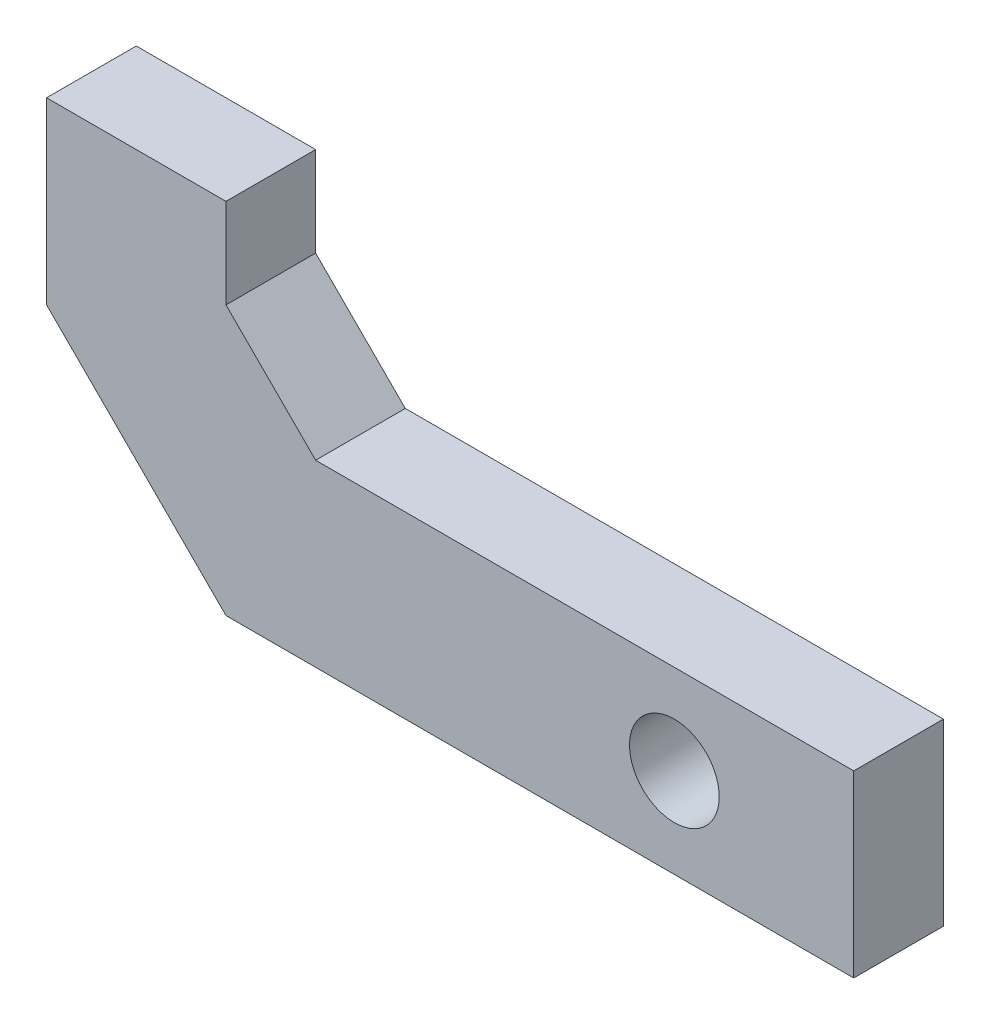
ISO-10303-21;
HEADER;
FILE_DESCRIPTION(('STEP AP214'),'2;1');
FILE_NAME('part.step','',(''),(''),'','','');
FILE_SCHEMA(('AUTOMOTIVE_DESIGN { 1 0 10303 214 1 1 1 1 }'));
ENDSEC;
DATA;
#1=APPLICATION_CONTEXT('core data for automotive mechanical design processes');
#2=APPLICATION_PROTOCOL_DEFINITION('international standard','automotive_design',2000,#1);
#3=PRODUCT_CONTEXT('',#1,'mechanical');
#4=PRODUCT('Part','Part','',(#3));
#5=PRODUCT_RELATED_PRODUCT_CATEGORY('part','',(#4));
#6=PRODUCT_DEFINITION_FORMATION('','',#4);
#7=PRODUCT_DEFINITION_CONTEXT('part definition',#1,'design');
#8=PRODUCT_DEFINITION('design','',#6,#7);
#9=PRODUCT_DEFINITION_SHAPE('','',#8);
#10=(LENGTH_UNIT() NAMED_UNIT(*) SI_UNIT(.MILLI.,.METRE.));
#11=(NAMED_UNIT(*) PLANE_ANGLE_UNIT() SI_UNIT($,.RADIAN.));
#12=(NAMED_UNIT(*) SI_UNIT($,.STERADIAN.) SOLID_ANGLE_UNIT());
#13=UNCERTAINTY_MEASURE_WITH_UNIT(LENGTH_MEASURE(1.E-05),#10,'distance_accuracy_value','');
#14=(GEOMETRIC_REPRESENTATION_CONTEXT(3) GLOBAL_UNCERTAINTY_ASSIGNED_CONTEXT((#13)) GLOBAL_UNIT_ASSIGNED_CONTEXT((#10,
#11,#12)) REPRESENTATION_CONTEXT('',''));
#15=CARTESIAN_POINT('',(0.,0.,0.));
#16=DIRECTION('',(0.,0.,1.));
#17=DIRECTION('',(1.,0.,0.));
#18=AXIS2_PLACEMENT_3D('',#15,#16,#17);
#19=CARTESIAN_POINT('',(17.78,0.,2.54));
#20=DIRECTION('',(0.,1.,0.));
#21=DIRECTION('',(-1.,0.,0.));
#22=AXIS2_PLACEMENT_3D('',#19,#20,#21);
#23=PLANE('',#22);
#24=DIRECTION('',(1.,0.,0.));
#25=VECTOR('',#24,1.);
#26=CARTESIAN_POINT('',(17.78,0.,0.));
#27=LINE('',#26,#25);
#28=CARTESIAN_POINT('',(0.,0.,0.));
#29=VERTEX_POINT('',#28);
#30=CARTESIAN_POINT('',(17.78,0.,0.));
#31=VERTEX_POINT('',#30);
#32=EDGE_CURVE('E129',#29,#31,#27,.T.);
#33=ORIENTED_EDGE('',*,*,#32,.T.);
#34=DIRECTION('',(0.,0.,-1.));
#35=VECTOR('',#34,1.);
#36=CARTESIAN_POINT('',(17.78,0.,2.54));
#37=LINE('',#36,#35);
#38=CARTESIAN_POINT('',(17.78,0.,2.54));
#39=VERTEX_POINT('',#38);
#40=EDGE_CURVE('E11',#39,#31,#37,.T.);
#41=ORIENTED_EDGE('',*,*,#40,.F.);
#42=DIRECTION('',(1.,0.,0.));
#43=VECTOR('',#42,1.);
#44=CARTESIAN_POINT('',(17.78,0.,2.54));
#45=LINE('',#44,#43);
#46=CARTESIAN_POINT('',(0.,0.,2.54));
#47=VERTEX_POINT('',#46);
#48=EDGE_CURVE('E144',#47,#39,#45,.T.);
#49=ORIENTED_EDGE('',*,*,#48,.F.);
#50=DIRECTION('',(0.,0.,-1.));
#51=VECTOR('',#50,1.);
#52=CARTESIAN_POINT('',(0.,0.,2.54));
#53=LINE('',#52,#51);
#54=EDGE_CURVE('E125',#47,#29,#53,.T.);
#55=ORIENTED_EDGE('',*,*,#54,.T.);
#56=EDGE_LOOP('',(#33,#41,#49,#55));
#57=FACE_BOUND('',#56,.T.);
#58=ADVANCED_FACE('F33',(#57),#23,.F.);
#59=CARTESIAN_POINT('',(17.78,5.08,2.54));
#60=DIRECTION('',(-1.,0.,0.));
#61=DIRECTION('',(0.,-1.,0.));
#62=AXIS2_PLACEMENT_3D('',#59,#60,#61);
#63=PLANE('',#62);
#64=DIRECTION('',(0.,1.,0.));
#65=VECTOR('',#64,1.);
#66=CARTESIAN_POINT('',(17.78,5.08,0.));
#67=LINE('',#66,#65);
#68=CARTESIAN_POINT('',(17.78,5.08,0.));
#69=VERTEX_POINT('',#68);
#70=EDGE_CURVE('E132',#31,#69,#67,.T.);
#71=ORIENTED_EDGE('',*,*,#70,.T.);
#72=DIRECTION('',(0.,0.,-1.));
#73=VECTOR('',#72,1.);
#74=CARTESIAN_POINT('',(17.78,5.08,2.54));
#75=LINE('',#74,#73);
#76=CARTESIAN_POINT('',(17.78,5.08,2.54));
#77=VERTEX_POINT('',#76);
#78=EDGE_CURVE('E41',#77,#69,#75,.T.);
#79=ORIENTED_EDGE('',*,*,#78,.F.);
#80=DIRECTION('',(0.,1.,0.));
#81=VECTOR('',#80,1.);
#82=CARTESIAN_POINT('',(17.78,5.08,2.54));
#83=LINE('',#82,#81);
#84=EDGE_CURVE('E92',#39,#77,#83,.T.);
#85=ORIENTED_EDGE('',*,*,#84,.F.);
#86=ORIENTED_EDGE('',*,*,#40,.T.);
#87=EDGE_LOOP('',(#71,#79,#85,#86));
#88=FACE_BOUND('',#87,.T.);
#89=ADVANCED_FACE('F197',(#88),#63,.F.);
#90=CARTESIAN_POINT('',(2.54,5.08,2.54));
#91=DIRECTION('',(0.,-1.,0.));
#92=DIRECTION('',(0.,0.,-1.));
#93=AXIS2_PLACEMENT_3D('',#90,#91,#92);
#94=PLANE('',#93);
#95=DIRECTION('',(-1.,0.,0.));
#96=VECTOR('',#95,1.);
#97=CARTESIAN_POINT('',(2.54,5.08,0.));
#98=LINE('',#97,#96);
#99=CARTESIAN_POINT('',(2.54,5.08,0.));
#100=VERTEX_POINT('',#99);
#101=EDGE_CURVE('E135',#69,#100,#98,.T.);
#102=ORIENTED_EDGE('',*,*,#101,.T.);
#103=DIRECTION('',(0.,0.,-1.));
#104=VECTOR('',#103,1.);
#105=CARTESIAN_POINT('',(2.54,5.08,2.54));
#106=LINE('',#105,#104);
#107=CARTESIAN_POINT('',(2.54,5.08,2.54));
#108=VERTEX_POINT('',#107);
#109=EDGE_CURVE('E151',#108,#100,#106,.T.);
#110=ORIENTED_EDGE('',*,*,#109,.F.);
#111=DIRECTION('',(-1.,0.,0.));
#112=VECTOR('',#111,1.);
#113=CARTESIAN_POINT('',(2.54,5.08,2.54));
#114=LINE('',#113,#112);
#115=EDGE_CURVE('E159',#77,#108,#114,.T.);
#116=ORIENTED_EDGE('',*,*,#115,.F.);
#117=ORIENTED_EDGE('',*,*,#78,.T.);
#118=EDGE_LOOP('',(#102,#110,#116,#117));
#119=FACE_BOUND('',#118,.T.);
#120=ADVANCED_FACE('F157',(#119),#94,.F.);
#121=CARTESIAN_POINT('',(0.,7.62000000000001,2.54));
#122=DIRECTION('',(-0.707106781186549,-0.707106781186546,0.));
#123=DIRECTION('',(0.707106781186546,-0.707106781186549,0.));
#124=AXIS2_PLACEMENT_3D('',#121,#122,#123);
#125=PLANE('',#124);
#126=DIRECTION('',(-0.707106781186546,0.707106781186549,0.));
#127=VECTOR('',#126,1.);
#128=CARTESIAN_POINT('',(0.,7.62000000000001,0.));
#129=LINE('',#128,#127);
#130=CARTESIAN_POINT('',(0.,7.62000000000001,0.));
#131=VERTEX_POINT('',#130);
#132=EDGE_CURVE('E137',#100,#131,#129,.T.);
#133=ORIENTED_EDGE('',*,*,#132,.T.);
#134=DIRECTION('',(0.,0.,-1.));
#135=VECTOR('',#134,1.);
#136=CARTESIAN_POINT('',(0.,7.62000000000001,2.54));
#137=LINE('',#136,#135);
#138=CARTESIAN_POINT('',(0.,7.62000000000001,2.54));
#139=VERTEX_POINT('',#138);
#140=EDGE_CURVE('E148',#139,#131,#137,.T.);
#141=ORIENTED_EDGE('',*,*,#140,.F.);
#142=DIRECTION('',(-0.707106781186546,0.707106781186549,0.));
#143=VECTOR('',#142,1.);
#144=CARTESIAN_POINT('',(0.,7.62000000000001,2.54));
#145=LINE('',#144,#143);
#146=EDGE_CURVE('E171',#108,#139,#145,.T.);
#147=ORIENTED_EDGE('',*,*,#146,.F.);
#148=ORIENTED_EDGE('',*,*,#109,.T.);
#149=EDGE_LOOP('',(#133,#141,#147,#148));
#150=FACE_BOUND('',#149,.T.);
#151=ADVANCED_FACE('F167',(#150),#125,.F.);
#152=CARTESIAN_POINT('',(0.,10.16,2.54));
#153=DIRECTION('',(-1.,0.,0.));
#154=DIRECTION('',(0.,-1.,0.));
#155=AXIS2_PLACEMENT_3D('',#152,#153,#154);
#156=PLANE('',#155);
#157=DIRECTION('',(0.,1.,0.));
#158=VECTOR('',#157,1.);
#159=CARTESIAN_POINT('',(0.,10.16,0.));
#160=LINE('',#159,#158);
#161=CARTESIAN_POINT('',(0.,10.16,0.));
#162=VERTEX_POINT('',#161);
#163=EDGE_CURVE('E139',#131,#162,#160,.T.);
#164=ORIENTED_EDGE('',*,*,#163,.T.);
#165=DIRECTION('',(0.,0.,-1.));
#166=VECTOR('',#165,1.);
#167=CARTESIAN_POINT('',(0.,10.16,2.54));
#168=LINE('',#167,#166);
#169=CARTESIAN_POINT('',(0.,10.16,2.54));
#170=VERTEX_POINT('',#169);
#171=EDGE_CURVE('E120',#170,#162,#168,.T.);
#172=ORIENTED_EDGE('',*,*,#171,.F.);
#173=DIRECTION('',(0.,1.,0.));
#174=VECTOR('',#173,1.);
#175=CARTESIAN_POINT('',(0.,10.16,2.54));
#176=LINE('',#175,#174);
#177=EDGE_CURVE('E111',#139,#170,#176,.T.);
#178=ORIENTED_EDGE('',*,*,#177,.F.);
#179=ORIENTED_EDGE('',*,*,#140,.T.);
#180=EDGE_LOOP('',(#164,#172,#178,#179));
#181=FACE_BOUND('',#180,.T.);
#182=ADVANCED_FACE('F170',(#181),#156,.F.);
#183=CARTESIAN_POINT('',(-5.08,10.16,2.54));
#184=DIRECTION('',(0.,-1.,0.));
#185=DIRECTION('',(0.,0.,-1.));
#186=AXIS2_PLACEMENT_3D('',#183,#184,#185);
#187=PLANE('',#186);
#188=DIRECTION('',(-1.,0.,0.));
#189=VECTOR('',#188,1.);
#190=CARTESIAN_POINT('',(-5.08,10.16,0.));
#191=LINE('',#190,#189);
#192=CARTESIAN_POINT('',(-5.08,10.16,0.));
#193=VERTEX_POINT('',#192);
#194=EDGE_CURVE('E119',#162,#193,#191,.T.);
#195=ORIENTED_EDGE('',*,*,#194,.T.);
#196=DIRECTION('',(0.,0.,-1.));
#197=VECTOR('',#196,1.);
#198=CARTESIAN_POINT('',(-5.08,10.16,2.54));
#199=LINE('',#198,#197);
#200=CARTESIAN_POINT('',(-5.08,10.16,2.54));
#201=VERTEX_POINT('',#200);
#202=EDGE_CURVE('E116',#201,#193,#199,.T.);
#203=ORIENTED_EDGE('',*,*,#202,.F.);
#204=DIRECTION('',(-1.,0.,0.));
#205=VECTOR('',#204,1.);
#206=CARTESIAN_POINT('',(-5.08,10.16,2.54));
#207=LINE('',#206,#205);
#208=EDGE_CURVE('E105',#170,#201,#207,.T.);
#209=ORIENTED_EDGE('',*,*,#208,.F.);
#210=ORIENTED_EDGE('',*,*,#171,.T.);
#211=EDGE_LOOP('',(#195,#203,#209,#210));
#212=FACE_BOUND('',#211,.T.);
#213=ADVANCED_FACE('F117',(#212),#187,.F.);
#214=CARTESIAN_POINT('',(-5.08,5.08,2.54));
#215=DIRECTION('',(1.,0.,0.));
#216=DIRECTION('',(0.,0.,-1.));
#217=AXIS2_PLACEMENT_3D('',#214,#215,#216);
#218=PLANE('',#217);
#219=DIRECTION('',(0.,-1.,0.));
#220=VECTOR('',#219,1.);
#221=CARTESIAN_POINT('',(-5.08,5.08,0.));
#222=LINE('',#221,#220);
#223=CARTESIAN_POINT('',(-5.08,5.08,0.));
#224=VERTEX_POINT('',#223);
#225=EDGE_CURVE('E78',#193,#224,#222,.T.);
#226=ORIENTED_EDGE('',*,*,#225,.T.);
#227=DIRECTION('',(0.,0.,-1.));
#228=VECTOR('',#227,1.);
#229=CARTESIAN_POINT('',(-5.08,5.08,2.54));
#230=LINE('',#229,#228);
#231=CARTESIAN_POINT('',(-5.08,5.08,2.54));
#232=VERTEX_POINT('',#231);
#233=EDGE_CURVE('E121',#232,#224,#230,.T.);
#234=ORIENTED_EDGE('',*,*,#233,.F.);
#235=DIRECTION('',(0.,-1.,0.));
#236=VECTOR('',#235,1.);
#237=CARTESIAN_POINT('',(-5.08,5.08,2.54));
#238=LINE('',#237,#236);
#239=EDGE_CURVE('E109',#201,#232,#238,.T.);
#240=ORIENTED_EDGE('',*,*,#239,.F.);
#241=ORIENTED_EDGE('',*,*,#202,.T.);
#242=EDGE_LOOP('',(#226,#234,#240,#241));
#243=FACE_BOUND('',#242,.T.);
#244=ADVANCED_FACE('F123',(#243),#218,.F.);
#245=CARTESIAN_POINT('',(0.,0.,2.54));
#246=DIRECTION('',(0.707106781186548,0.707106781186547,0.));
#247=DIRECTION('',(-0.707106781186547,0.707106781186548,0.));
#248=AXIS2_PLACEMENT_3D('',#245,#246,#247);
#249=PLANE('',#248);
#250=DIRECTION('',(0.707106781186547,-0.707106781186548,0.));
#251=VECTOR('',#250,1.);
#252=CARTESIAN_POINT('',(0.,0.,0.));
#253=LINE('',#252,#251);
#254=EDGE_CURVE('E84',#224,#29,#253,.T.);
#255=ORIENTED_EDGE('',*,*,#254,.T.);
#256=ORIENTED_EDGE('',*,*,#54,.F.);
#257=DIRECTION('',(0.707106781186547,-0.707106781186548,0.));
#258=VECTOR('',#257,1.);
#259=CARTESIAN_POINT('',(0.,0.,2.54));
#260=LINE('',#259,#258);
#261=EDGE_CURVE('E49',#232,#47,#260,.T.);
#262=ORIENTED_EDGE('',*,*,#261,.F.);
#263=ORIENTED_EDGE('',*,*,#233,.T.);
#264=EDGE_LOOP('',(#255,#256,#262,#263));
#265=FACE_BOUND('',#264,.T.);
#266=ADVANCED_FACE('F186',(#265),#249,.F.);
#267=CARTESIAN_POINT('',(-5.08,0.,2.54));
#268=DIRECTION('',(0.,0.,-1.));
#269=DIRECTION('',(-1.,0.,0.));
#270=AXIS2_PLACEMENT_3D('',#267,#268,#269);
#271=PLANE('',#270);
#272=CARTESIAN_POINT('',(12.7,2.54,2.54));
#273=DIRECTION('',(0.,0.,1.));
#274=DIRECTION('',(1.,0.,0.));
#275=AXIS2_PLACEMENT_3D('',#272,#273,#274);
#276=CIRCLE('',#275,1.27);
#277=CARTESIAN_POINT('',(13.97,2.54,2.54));
#278=VERTEX_POINT('',#277);
#279=EDGE_CURVE('E133',#278,#278,#276,.T.);
#280=ORIENTED_EDGE('',*,*,#279,.F.);
#281=EDGE_LOOP('',(#280));
#282=FACE_BOUND('',#281,.T.);
#283=ORIENTED_EDGE('',*,*,#48,.T.);
#284=ORIENTED_EDGE('',*,*,#84,.T.);
#285=ORIENTED_EDGE('',*,*,#115,.T.);
#286=ORIENTED_EDGE('',*,*,#146,.T.);
#287=ORIENTED_EDGE('',*,*,#177,.T.);
#288=ORIENTED_EDGE('',*,*,#208,.T.);
#289=ORIENTED_EDGE('',*,*,#239,.T.);
#290=ORIENTED_EDGE('',*,*,#261,.T.);
#291=EDGE_LOOP('',(#283,#284,#285,#286,#287,#288,#289,#290));
#292=FACE_BOUND('',#291,.T.);
#293=ADVANCED_FACE('F107',(#282,#292),#271,.F.);
#294=CARTESIAN_POINT('',(-5.08,0.,0.));
#295=DIRECTION('',(0.,0.,-1.));
#296=DIRECTION('',(-1.,0.,0.));
#297=AXIS2_PLACEMENT_3D('',#294,#295,#296);
#298=PLANE('',#297);
#299=CARTESIAN_POINT('',(12.7,2.54,0.));
#300=DIRECTION('',(0.,0.,-1.));
#301=DIRECTION('',(-1.,0.,0.));
#302=AXIS2_PLACEMENT_3D('',#299,#300,#301);
#303=CIRCLE('',#302,1.27);
#304=CARTESIAN_POINT('',(11.43,2.54,0.));
#305=VERTEX_POINT('',#304);
#306=EDGE_CURVE('E177',#305,#305,#303,.F.);
#307=ORIENTED_EDGE('',*,*,#306,.T.);
#308=EDGE_LOOP('',(#307));
#309=FACE_BOUND('',#308,.T.);
#310=ORIENTED_EDGE('',*,*,#32,.F.);
#311=ORIENTED_EDGE('',*,*,#254,.F.);
#312=ORIENTED_EDGE('',*,*,#225,.F.);
#313=ORIENTED_EDGE('',*,*,#194,.F.);
#314=ORIENTED_EDGE('',*,*,#163,.F.);
#315=ORIENTED_EDGE('',*,*,#132,.F.);
#316=ORIENTED_EDGE('',*,*,#101,.F.);
#317=ORIENTED_EDGE('',*,*,#70,.F.);
#318=EDGE_LOOP('',(#310,#311,#312,#313,#314,#315,#316,#317));
#319=FACE_BOUND('',#318,.T.);
#320=ADVANCED_FACE('F163',(#309,#319),#298,.T.);
#321=CARTESIAN_POINT('',(12.7,2.54,-0.00100000000000013));
#322=DIRECTION('',(0.,0.,1.));
#323=DIRECTION('',(1.,0.,0.));
#324=AXIS2_PLACEMENT_3D('',#321,#322,#323);
#325=CYLINDRICAL_SURFACE('',#324,1.27);
#326=ORIENTED_EDGE('',*,*,#306,.F.);
#327=EDGE_LOOP('',(#326));
#328=FACE_BOUND('',#327,.T.);
#329=ORIENTED_EDGE('',*,*,#279,.T.);
#330=EDGE_LOOP('',(#329));
#331=FACE_BOUND('',#330,.T.);
#332=ADVANCED_FACE('F183',(#328,#331),#325,.F.);
#333=CLOSED_SHELL('',(#58,#89,#120,#151,#182,#213,#244,#266,#293,#320,#332));
#334=MANIFOLD_SOLID_BREP('B2',#333);
#335=ADVANCED_BREP_SHAPE_REPRESENTATION('',(#18,#334),#14);
#336=SHAPE_DEFINITION_REPRESENTATION(#9,#335);
ENDSEC;
END-ISO-10303-21;
